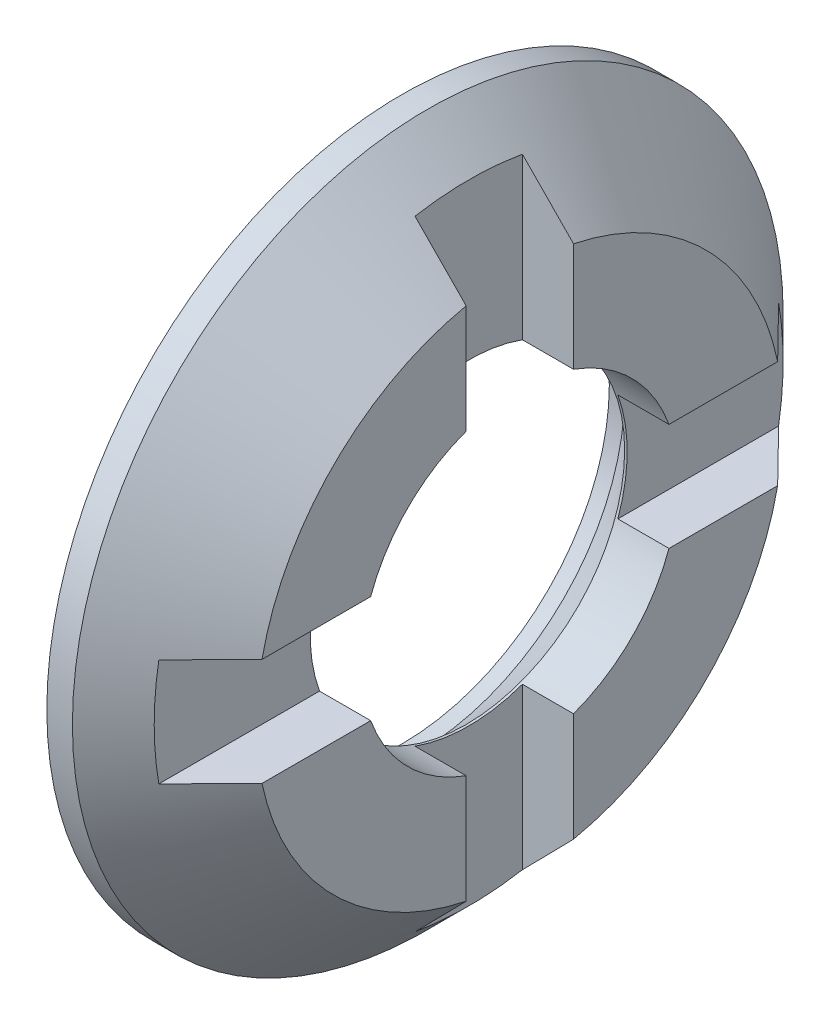
ISO-10303-21;
HEADER;
FILE_DESCRIPTION(('STEP AP214'),'2;1');
FILE_NAME('part.step','',(''),(''),'','','');
FILE_SCHEMA(('AUTOMOTIVE_DESIGN { 1 0 10303 214 1 1 1 1 }'));
ENDSEC;
DATA;
#1=APPLICATION_CONTEXT('core data for automotive mechanical design processes');
#2=APPLICATION_PROTOCOL_DEFINITION('international standard','automotive_design',2000,#1);
#3=PRODUCT_CONTEXT('',#1,'mechanical');
#4=PRODUCT('Part','Part','',(#3));
#5=PRODUCT_RELATED_PRODUCT_CATEGORY('part','',(#4));
#6=PRODUCT_DEFINITION_FORMATION('','',#4);
#7=PRODUCT_DEFINITION_CONTEXT('part definition',#1,'design');
#8=PRODUCT_DEFINITION('design','',#6,#7);
#9=PRODUCT_DEFINITION_SHAPE('','',#8);
#10=(LENGTH_UNIT() NAMED_UNIT(*) SI_UNIT(.MILLI.,.METRE.));
#11=(NAMED_UNIT(*) PLANE_ANGLE_UNIT() SI_UNIT($,.RADIAN.));
#12=(NAMED_UNIT(*) SI_UNIT($,.STERADIAN.) SOLID_ANGLE_UNIT());
#13=UNCERTAINTY_MEASURE_WITH_UNIT(LENGTH_MEASURE(1.E-05),#10,'distance_accuracy_value','');
#14=(GEOMETRIC_REPRESENTATION_CONTEXT(3) GLOBAL_UNCERTAINTY_ASSIGNED_CONTEXT((#13)) GLOBAL_UNIT_ASSIGNED_CONTEXT((#10,
#11,#12)) REPRESENTATION_CONTEXT('',''));
#15=CARTESIAN_POINT('',(0.,0.,0.));
#16=DIRECTION('',(0.,0.,1.));
#17=DIRECTION('',(1.,0.,0.));
#18=AXIS2_PLACEMENT_3D('',#15,#16,#17);
#19=CARTESIAN_POINT('',(-8.43297067855262,15.,-1.05));
#20=DIRECTION('',(0.,0.,-1.));
#21=DIRECTION('',(-1.,0.,0.));
#22=AXIS2_PLACEMENT_3D('',#19,#20,#21);
#23=PLANE('',#22);
#24=CARTESIAN_POINT('',(-8.43297067857819,21.0597029630019,-1.05));
#25=CARTESIAN_POINT('',(-8.2660332643413,20.8903226578739,-1.05));
#26=CARTESIAN_POINT('',(-8.09923122857827,20.7208093520447,-1.05));
#27=CARTESIAN_POINT('',(-7.76589789521229,20.3815167198608,-1.05));
#28=CARTESIAN_POINT('',(-7.59936659763985,20.2117373934761,-1.05));
#29=CARTESIAN_POINT('',(-7.43297067857179,20.0418250663602,-1.05));
#30=B_SPLINE_CURVE_WITH_KNOTS('',3,(#24,#25,#26,#27,#28,#29),.UNSPECIFIED.,.F.,.F.,(4,2,4),(0.,
0.713455758887881,1.4269115982006),.UNSPECIFIED.);
#31=CARTESIAN_POINT('',(-8.43297067858806,21.0597029630119,-1.05));
#32=VERTEX_POINT('',#31);
#33=CARTESIAN_POINT('',(-7.43297067856827,20.0418250663566,-1.05));
#34=VERTEX_POINT('',#33);
#35=EDGE_CURVE('E21',#32,#34,#30,.T.);
#36=ORIENTED_EDGE('',*,*,#35,.F.);
#37=DIRECTION('',(0.,1.,0.));
#38=VECTOR('',#37,1.);
#39=CARTESIAN_POINT('',(-8.43297067855262,15.,-1.05));
#40=LINE('',#39,#38);
#41=CARTESIAN_POINT('',(-8.43297067855262,17.916761903207,-1.05));
#42=VERTEX_POINT('',#41);
#43=EDGE_CURVE('E176',#42,#32,#40,.T.);
#44=ORIENTED_EDGE('',*,*,#43,.F.);
#45=DIRECTION('',(-1.,0.,0.));
#46=VECTOR('',#45,1.);
#47=CARTESIAN_POINT('',(-8.43297067855262,17.916761903207,-1.05));
#48=LINE('',#47,#46);
#49=CARTESIAN_POINT('',(-7.43297067855262,17.916761903207,-1.05));
#50=VERTEX_POINT('',#49);
#51=EDGE_CURVE('E274',#50,#42,#48,.T.);
#52=ORIENTED_EDGE('',*,*,#51,.F.);
#53=DIRECTION('',(0.,1.,0.));
#54=VECTOR('',#53,1.);
#55=CARTESIAN_POINT('',(-7.43297067855262,15.,-1.05));
#56=LINE('',#55,#54);
#57=EDGE_CURVE('E309',#34,#50,#56,.F.);
#58=ORIENTED_EDGE('',*,*,#57,.F.);
#59=EDGE_LOOP('',(#36,#44,#52,#58));
#60=FACE_BOUND('',#59,.T.);
#61=ADVANCED_FACE('F17',(#60),#23,.F.);
#62=CARTESIAN_POINT('',(-8.43297067855262,16.05,0.));
#63=DIRECTION('',(0.,1.,0.));
#64=DIRECTION('',(0.,0.,1.));
#65=AXIS2_PLACEMENT_3D('',#62,#63,#64);
#66=PLANE('',#65);
#67=DIRECTION('',(1.,0.,0.));
#68=VECTOR('',#67,1.);
#69=CARTESIAN_POINT('',(-8.43297067855262,16.05,-2.91676190320704));
#70=LINE('',#69,#68);
#71=CARTESIAN_POINT('',(-8.43297067855262,16.05,-2.91676190320704));
#72=VERTEX_POINT('',#71);
#73=CARTESIAN_POINT('',(-7.43297067855262,16.05,-2.91676190320704));
#74=VERTEX_POINT('',#73);
#75=EDGE_CURVE('E228',#72,#74,#70,.T.);
#76=ORIENTED_EDGE('',*,*,#75,.F.);
#77=DIRECTION('',(0.,0.,-1.));
#78=VECTOR('',#77,1.);
#79=CARTESIAN_POINT('',(-8.43297067855262,16.05,-1.05));
#80=LINE('',#79,#78);
#81=CARTESIAN_POINT('',(-8.43297067858806,16.05,-6.05970296301193));
#82=VERTEX_POINT('',#81);
#83=EDGE_CURVE('E307',#82,#72,#80,.F.);
#84=ORIENTED_EDGE('',*,*,#83,.F.);
#85=CARTESIAN_POINT('',(-7.43297067857179,16.05,-5.04182506636023));
#86=CARTESIAN_POINT('',(-7.59936659763985,16.05,-5.21173739347606));
#87=CARTESIAN_POINT('',(-7.76589789521229,16.05,-5.38151671986083));
#88=CARTESIAN_POINT('',(-8.09923122857828,16.05,-5.72080935204473));
#89=CARTESIAN_POINT('',(-8.26603326434131,16.05,-5.89032265787385));
#90=CARTESIAN_POINT('',(-8.43297067857819,16.05,-6.0597029630019));
#91=B_SPLINE_CURVE_WITH_KNOTS('',3,(#85,#86,#87,#88,#89,#90),.UNSPECIFIED.,.F.,.F.,(4,2,4),(0.,
0.713455839312716,1.4269115982006),.UNSPECIFIED.);
#92=CARTESIAN_POINT('',(-7.43297067856827,16.05,-5.04182506635664));
#93=VERTEX_POINT('',#92);
#94=EDGE_CURVE('E224',#93,#82,#91,.T.);
#95=ORIENTED_EDGE('',*,*,#94,.F.);
#96=DIRECTION('',(0.,0.,-1.));
#97=VECTOR('',#96,1.);
#98=CARTESIAN_POINT('',(-7.43297067855262,16.05,0.));
#99=LINE('',#98,#97);
#100=EDGE_CURVE('E175',#74,#93,#99,.T.);
#101=ORIENTED_EDGE('',*,*,#100,.F.);
#102=EDGE_LOOP('',(#76,#84,#95,#101));
#103=FACE_BOUND('',#102,.T.);
#104=ADVANCED_FACE('F229',(#103),#66,.F.);
#105=CARTESIAN_POINT('',(-8.43297067855262,15.,-1.05));
#106=DIRECTION('',(0.,0.,-1.));
#107=DIRECTION('',(0.,1.,0.));
#108=AXIS2_PLACEMENT_3D('',#105,#106,#107);
#109=PLANE('',#108);
#110=DIRECTION('',(1.,0.,0.));
#111=VECTOR('',#110,1.);
#112=CARTESIAN_POINT('',(-8.43297067855262,12.083238096793,-1.05000000000002));
#113=LINE('',#112,#111);
#114=CARTESIAN_POINT('',(-8.43297067855262,12.083238096793,-1.05000000000003));
#115=VERTEX_POINT('',#114);
#116=CARTESIAN_POINT('',(-7.43297067855262,12.083238096793,-1.05000000000002));
#117=VERTEX_POINT('',#116);
#118=EDGE_CURVE('E269',#115,#117,#113,.T.);
#119=ORIENTED_EDGE('',*,*,#118,.F.);
#120=DIRECTION('',(0.,1.,0.));
#121=VECTOR('',#120,1.);
#122=CARTESIAN_POINT('',(-8.43297067855262,15.,-1.05000000000004));
#123=LINE('',#122,#121);
#124=CARTESIAN_POINT('',(-8.43297067858806,8.94029703698808,-1.05000000000004));
#125=VERTEX_POINT('',#124);
#126=EDGE_CURVE('E117',#125,#115,#123,.T.);
#127=ORIENTED_EDGE('',*,*,#126,.F.);
#128=CARTESIAN_POINT('',(-7.43297067857179,9.95817493363977,-1.05000000000003));
#129=CARTESIAN_POINT('',(-7.59936659763985,9.78826260652394,-1.05000000000003));
#130=CARTESIAN_POINT('',(-7.76589789521229,9.61848328013917,-1.05000000000004));
#131=CARTESIAN_POINT('',(-8.09923122857827,9.27919064795527,-1.05000000000004));
#132=CARTESIAN_POINT('',(-8.2660332643413,9.10967734212615,-1.05000000000004));
#133=CARTESIAN_POINT('',(-8.43297067857818,8.9402970369981,-1.05000000000004));
#134=B_SPLINE_CURVE_WITH_KNOTS('',3,(#128,#129,#130,#131,#132,#133),.UNSPECIFIED.,.F.,.F.,(4,2,
4),(0.,0.713455839312715,1.4269115982006),.UNSPECIFIED.);
#135=CARTESIAN_POINT('',(-7.43297067856827,9.95817493364336,-1.05000000000003));
#136=VERTEX_POINT('',#135);
#137=EDGE_CURVE('E217',#136,#125,#134,.T.);
#138=ORIENTED_EDGE('',*,*,#137,.F.);
#139=DIRECTION('',(0.,1.,0.));
#140=VECTOR('',#139,1.);
#141=CARTESIAN_POINT('',(-7.43297067855262,15.,-1.05000000000002));
#142=LINE('',#141,#140);
#143=EDGE_CURVE('E302',#117,#136,#142,.F.);
#144=ORIENTED_EDGE('',*,*,#143,.F.);
#145=EDGE_LOOP('',(#119,#127,#138,#144));
#146=FACE_BOUND('',#145,.T.);
#147=ADVANCED_FACE('F232',(#146),#109,.F.);
#148=CARTESIAN_POINT('',(-8.43297067855262,13.95,0.));
#149=DIRECTION('',(0.,-1.,0.));
#150=DIRECTION('',(0.,0.,-1.));
#151=AXIS2_PLACEMENT_3D('',#148,#149,#150);
#152=PLANE('',#151);
#153=CARTESIAN_POINT('',(-8.43297067857819,13.9500000000001,-6.05970296300191));
#154=CARTESIAN_POINT('',(-8.26603326434131,13.9500000000001,-5.89032265787387));
#155=CARTESIAN_POINT('',(-8.09923122857827,13.9500000000001,-5.72080935204475));
#156=CARTESIAN_POINT('',(-7.76589789521229,13.9500000000001,-5.38151671986084));
#157=CARTESIAN_POINT('',(-7.59936659763985,13.9500000000001,-5.21173739347608));
#158=CARTESIAN_POINT('',(-7.43297067857179,13.9500000000001,-5.04182506636025));
#159=B_SPLINE_CURVE_WITH_KNOTS('',3,(#153,#154,#155,#156,#157,#158),.UNSPECIFIED.,.F.,.F.,(4,2,
4),(0.,0.713455758887881,1.4269115982006),.UNSPECIFIED.);
#160=CARTESIAN_POINT('',(-8.43297067858806,13.95,-6.05970296301194));
#161=VERTEX_POINT('',#160);
#162=CARTESIAN_POINT('',(-7.43297067856827,13.9500000000001,-5.04182506635665));
#163=VERTEX_POINT('',#162);
#164=EDGE_CURVE('E210',#161,#163,#159,.T.);
#165=ORIENTED_EDGE('',*,*,#164,.F.);
#166=DIRECTION('',(0.,0.,-1.));
#167=VECTOR('',#166,1.);
#168=CARTESIAN_POINT('',(-8.43297067855262,13.95,-1.05));
#169=LINE('',#168,#167);
#170=CARTESIAN_POINT('',(-8.43297067855262,13.95,-2.91676190320706));
#171=VERTEX_POINT('',#170);
#172=EDGE_CURVE('E305',#171,#161,#169,.T.);
#173=ORIENTED_EDGE('',*,*,#172,.F.);
#174=DIRECTION('',(1.,0.,0.));
#175=VECTOR('',#174,1.);
#176=CARTESIAN_POINT('',(-8.43297067855262,13.95,-2.91676190320706));
#177=LINE('',#176,#175);
#178=CARTESIAN_POINT('',(-7.43297067855262,13.95,-2.91676190320706));
#179=VERTEX_POINT('',#178);
#180=EDGE_CURVE('E264',#179,#171,#177,.F.);
#181=ORIENTED_EDGE('',*,*,#180,.F.);
#182=DIRECTION('',(0.,0.,-1.));
#183=VECTOR('',#182,1.);
#184=CARTESIAN_POINT('',(-7.43297067855262,13.9500000000001,0.));
#185=LINE('',#184,#183);
#186=EDGE_CURVE('E299',#163,#179,#185,.F.);
#187=ORIENTED_EDGE('',*,*,#186,.F.);
#188=EDGE_LOOP('',(#165,#173,#181,#187));
#189=FACE_BOUND('',#188,.T.);
#190=ADVANCED_FACE('F236',(#189),#152,.F.);
#191=CARTESIAN_POINT('',(-8.43297067855262,15.,1.05));
#192=DIRECTION('',(0.,0.,1.));
#193=DIRECTION('',(0.,-1.,0.));
#194=AXIS2_PLACEMENT_3D('',#191,#192,#193);
#195=PLANE('',#194);
#196=CARTESIAN_POINT('',(-8.43297067857819,8.94029703699809,1.05));
#197=CARTESIAN_POINT('',(-8.26603326434131,9.10967734212614,1.05));
#198=CARTESIAN_POINT('',(-8.09923122857827,9.27919064795526,1.05));
#199=CARTESIAN_POINT('',(-7.76589789521229,9.61848328013916,1.05));
#200=CARTESIAN_POINT('',(-7.59936659763985,9.78826260652393,1.05));
#201=CARTESIAN_POINT('',(-7.43297067857179,9.95817493363976,1.05));
#202=B_SPLINE_CURVE_WITH_KNOTS('',3,(#196,#197,#198,#199,#200,#201),.UNSPECIFIED.,.F.,.F.,(4,2,
4),(0.,0.713455758887883,1.4269115982006),.UNSPECIFIED.);
#203=CARTESIAN_POINT('',(-8.43297067858806,8.94029703698807,1.04999999999999));
#204=VERTEX_POINT('',#203);
#205=CARTESIAN_POINT('',(-7.43297067856827,9.95817493364335,1.04999999999998));
#206=VERTEX_POINT('',#205);
#207=EDGE_CURVE('E248',#204,#206,#202,.T.);
#208=ORIENTED_EDGE('',*,*,#207,.F.);
#209=DIRECTION('',(0.,1.,0.));
#210=VECTOR('',#209,1.);
#211=CARTESIAN_POINT('',(-8.43297067855261,15.,1.04999999999998));
#212=LINE('',#211,#210);
#213=CARTESIAN_POINT('',(-8.43297067855262,12.0832380967929,1.04999999999999));
#214=VERTEX_POINT('',#213);
#215=EDGE_CURVE('E179',#214,#204,#212,.F.);
#216=ORIENTED_EDGE('',*,*,#215,.F.);
#217=DIRECTION('',(1.,0.,0.));
#218=VECTOR('',#217,1.);
#219=CARTESIAN_POINT('',(-8.43297067855262,12.0832380967929,1.05));
#220=LINE('',#219,#218);
#221=CARTESIAN_POINT('',(-7.43297067855262,12.0832380967929,1.04999999999998));
#222=VERTEX_POINT('',#221);
#223=EDGE_CURVE('E252',#222,#214,#220,.F.);
#224=ORIENTED_EDGE('',*,*,#223,.F.);
#225=DIRECTION('',(0.,1.,0.));
#226=VECTOR('',#225,1.);
#227=CARTESIAN_POINT('',(-7.43297067855262,15.,1.04999999999997));
#228=LINE('',#227,#226);
#229=EDGE_CURVE('E293',#206,#222,#228,.T.);
#230=ORIENTED_EDGE('',*,*,#229,.F.);
#231=EDGE_LOOP('',(#208,#216,#224,#230));
#232=FACE_BOUND('',#231,.T.);
#233=ADVANCED_FACE('F241',(#232),#195,.F.);
#234=CARTESIAN_POINT('',(-8.43297067855262,13.95,0.));
#235=DIRECTION('',(0.,-1.,0.));
#236=DIRECTION('',(0.,0.,-1.));
#237=AXIS2_PLACEMENT_3D('',#234,#235,#236);
#238=PLANE('',#237);
#239=DIRECTION('',(1.,0.,0.));
#240=VECTOR('',#239,1.);
#241=CARTESIAN_POINT('',(-8.43297067855262,13.95,2.91676190320705));
#242=LINE('',#241,#240);
#243=CARTESIAN_POINT('',(-8.43297067855261,13.95,2.91676190320705));
#244=VERTEX_POINT('',#243);
#245=CARTESIAN_POINT('',(-7.43297067855262,13.95,2.91676190320705));
#246=VERTEX_POINT('',#245);
#247=EDGE_CURVE('E255',#244,#246,#242,.T.);
#248=ORIENTED_EDGE('',*,*,#247,.F.);
#249=DIRECTION('',(0.,0.,-1.));
#250=VECTOR('',#249,1.);
#251=CARTESIAN_POINT('',(-8.43297067855262,13.95,-1.05));
#252=LINE('',#251,#250);
#253=CARTESIAN_POINT('',(-8.43297067858806,13.95,6.05970296301193));
#254=VERTEX_POINT('',#253);
#255=EDGE_CURVE('E128',#254,#244,#252,.T.);
#256=ORIENTED_EDGE('',*,*,#255,.F.);
#257=CARTESIAN_POINT('',(-7.43297067857179,13.95,5.04182506636024));
#258=CARTESIAN_POINT('',(-7.59936659763985,13.95,5.21173739347607));
#259=CARTESIAN_POINT('',(-7.76589789521228,13.95,5.38151671986083));
#260=CARTESIAN_POINT('',(-8.09923122857827,13.95,5.72080935204474));
#261=CARTESIAN_POINT('',(-8.2660332643413,13.95,5.89032265787386));
#262=CARTESIAN_POINT('',(-8.43297067857818,13.95,6.0597029630019));
#263=B_SPLINE_CURVE_WITH_KNOTS('',3,(#257,#258,#259,#260,#261,#262),.UNSPECIFIED.,.F.,.F.,(4,2,
4),(0.,0.713455839312714,1.42691159820059),.UNSPECIFIED.);
#264=CARTESIAN_POINT('',(-7.43297067856826,13.95,5.04182506635664));
#265=VERTEX_POINT('',#264);
#266=EDGE_CURVE('E134',#265,#254,#263,.T.);
#267=ORIENTED_EDGE('',*,*,#266,.F.);
#268=DIRECTION('',(0.,0.,-1.));
#269=VECTOR('',#268,1.);
#270=CARTESIAN_POINT('',(-7.43297067855262,13.95,0.));
#271=LINE('',#270,#269);
#272=EDGE_CURVE('E296',#246,#265,#271,.F.);
#273=ORIENTED_EDGE('',*,*,#272,.F.);
#274=EDGE_LOOP('',(#248,#256,#267,#273));
#275=FACE_BOUND('',#274,.T.);
#276=ADVANCED_FACE('F245',(#275),#238,.F.);
#277=CARTESIAN_POINT('',(-8.43297067855262,15.,1.05));
#278=DIRECTION('',(0.,0.,1.));
#279=DIRECTION('',(0.,-1.,0.));
#280=AXIS2_PLACEMENT_3D('',#277,#278,#279);
#281=PLANE('',#280);
#282=DIRECTION('',(1.,0.,0.));
#283=VECTOR('',#282,1.);
#284=CARTESIAN_POINT('',(-8.43297067855262,17.916761903207,1.05));
#285=LINE('',#284,#283);
#286=CARTESIAN_POINT('',(-8.43297067855261,17.916761903207,1.05));
#287=VERTEX_POINT('',#286);
#288=CARTESIAN_POINT('',(-7.43297067855262,17.916761903207,1.05));
#289=VERTEX_POINT('',#288);
#290=EDGE_CURVE('E323',#287,#289,#285,.T.);
#291=ORIENTED_EDGE('',*,*,#290,.F.);
#292=DIRECTION('',(0.,1.,0.));
#293=VECTOR('',#292,1.);
#294=CARTESIAN_POINT('',(-8.43297067855261,15.,1.05));
#295=LINE('',#294,#293);
#296=CARTESIAN_POINT('',(-8.43297067858806,21.0597029630119,1.05));
#297=VERTEX_POINT('',#296);
#298=EDGE_CURVE('E178',#297,#287,#295,.F.);
#299=ORIENTED_EDGE('',*,*,#298,.F.);
#300=CARTESIAN_POINT('',(-7.43297067857179,20.0418250663602,1.05));
#301=CARTESIAN_POINT('',(-7.59936659763985,20.2117373934761,1.05));
#302=CARTESIAN_POINT('',(-7.76589789521229,20.3815167198608,1.05));
#303=CARTESIAN_POINT('',(-8.09923122857827,20.7208093520447,1.05));
#304=CARTESIAN_POINT('',(-8.2660332643413,20.8903226578739,1.05));
#305=CARTESIAN_POINT('',(-8.43297067857818,21.0597029630019,1.05));
#306=B_SPLINE_CURVE_WITH_KNOTS('',3,(#300,#301,#302,#303,#304,#305),.UNSPECIFIED.,.F.,.F.,(4,2,
4),(0.,0.713455839312717,1.4269115982006),.UNSPECIFIED.);
#307=CARTESIAN_POINT('',(-7.43297067856827,20.0418250663566,1.05));
#308=VERTEX_POINT('',#307);
#309=EDGE_CURVE('E40',#308,#297,#306,.T.);
#310=ORIENTED_EDGE('',*,*,#309,.F.);
#311=DIRECTION('',(0.,1.,0.));
#312=VECTOR('',#311,1.);
#313=CARTESIAN_POINT('',(-7.43297067855262,15.,1.05));
#314=LINE('',#313,#312);
#315=EDGE_CURVE('E127',#289,#308,#314,.T.);
#316=ORIENTED_EDGE('',*,*,#315,.F.);
#317=EDGE_LOOP('',(#291,#299,#310,#316));
#318=FACE_BOUND('',#317,.T.);
#319=ADVANCED_FACE('F382',(#318),#281,.F.);
#320=CARTESIAN_POINT('',(-8.43297067855262,16.05,0.));
#321=DIRECTION('',(0.,1.,0.));
#322=DIRECTION('',(0.,0.,1.));
#323=AXIS2_PLACEMENT_3D('',#320,#321,#322);
#324=PLANE('',#323);
#325=CARTESIAN_POINT('',(-8.43297067857818,16.05,6.05970296300191));
#326=CARTESIAN_POINT('',(-8.2660332643413,16.05,5.89032265787387));
#327=CARTESIAN_POINT('',(-8.09923122857827,16.05,5.72080935204474));
#328=CARTESIAN_POINT('',(-7.76589789521228,16.05,5.38151671986084));
#329=CARTESIAN_POINT('',(-7.59936659763985,16.05,5.21173739347607));
#330=CARTESIAN_POINT('',(-7.43297067857179,16.05,5.04182506636025));
#331=B_SPLINE_CURVE_WITH_KNOTS('',3,(#325,#326,#327,#328,#329,#330),.UNSPECIFIED.,.F.,.F.,(4,2,
4),(0.,0.713455758887883,1.4269115982006),.UNSPECIFIED.);
#332=CARTESIAN_POINT('',(-8.43297067858806,16.05,6.05970296301193));
#333=VERTEX_POINT('',#332);
#334=CARTESIAN_POINT('',(-7.43297067856826,16.05,5.04182506635665));
#335=VERTEX_POINT('',#334);
#336=EDGE_CURVE('E104',#333,#335,#331,.T.);
#337=ORIENTED_EDGE('',*,*,#336,.F.);
#338=DIRECTION('',(0.,0.,-1.));
#339=VECTOR('',#338,1.);
#340=CARTESIAN_POINT('',(-8.43297067855262,16.05,-1.05));
#341=LINE('',#340,#339);
#342=CARTESIAN_POINT('',(-8.43297067855261,16.05,2.91676190320705));
#343=VERTEX_POINT('',#342);
#344=EDGE_CURVE('E109',#343,#333,#341,.F.);
#345=ORIENTED_EDGE('',*,*,#344,.F.);
#346=DIRECTION('',(1.,0.,0.));
#347=VECTOR('',#346,1.);
#348=CARTESIAN_POINT('',(-8.43297067855262,16.05,2.91676190320705));
#349=LINE('',#348,#347);
#350=CARTESIAN_POINT('',(-7.43297067855261,16.05,2.91676190320705));
#351=VERTEX_POINT('',#350);
#352=EDGE_CURVE('E118',#351,#343,#349,.F.);
#353=ORIENTED_EDGE('',*,*,#352,.F.);
#354=DIRECTION('',(0.,0.,-1.));
#355=VECTOR('',#354,1.);
#356=CARTESIAN_POINT('',(-7.43297067855262,16.05,0.));
#357=LINE('',#356,#355);
#358=EDGE_CURVE('E112',#335,#351,#357,.T.);
#359=ORIENTED_EDGE('',*,*,#358,.F.);
#360=EDGE_LOOP('',(#337,#345,#353,#359));
#361=FACE_BOUND('',#360,.T.);
#362=ADVANCED_FACE('F106',(#361),#324,.F.);
#363=CARTESIAN_POINT('',(-8.43297067855262,15.,-1.05));
#364=DIRECTION('',(1.,0.,0.));
#365=DIRECTION('',(0.,0.,-1.));
#366=AXIS2_PLACEMENT_3D('',#363,#364,#365);
#367=PLANE('',#366);
#368=ORIENTED_EDGE('',*,*,#215,.T.);
#369=CARTESIAN_POINT('',(-8.43297067859794,15.,0.));
#370=DIRECTION('',(-1.,0.,0.));
#371=DIRECTION('',(0.,0.,1.));
#372=AXIS2_PLACEMENT_3D('',#369,#370,#371);
#373=CIRCLE('',#372,6.15000000000464);
#374=EDGE_CURVE('E177',#204,#125,#373,.F.);
#375=ORIENTED_EDGE('',*,*,#374,.T.);
#376=ORIENTED_EDGE('',*,*,#126,.T.);
#377=CARTESIAN_POINT('',(-8.43297067855262,15.,0.));
#378=DIRECTION('',(-1.,0.,0.));
#379=DIRECTION('',(0.,0.,1.));
#380=AXIS2_PLACEMENT_3D('',#377,#378,#379);
#381=CIRCLE('',#380,3.1);
#382=EDGE_CURVE('E167',#115,#214,#381,.T.);
#383=ORIENTED_EDGE('',*,*,#382,.T.);
#384=EDGE_LOOP('',(#368,#375,#376,#383));
#385=FACE_BOUND('',#384,.T.);
#386=ADVANCED_FACE('F344',(#385),#367,.T.);
#387=CARTESIAN_POINT('',(-8.43297067855262,15.,-1.05));
#388=DIRECTION('',(1.,0.,0.));
#389=DIRECTION('',(0.,0.,-1.));
#390=AXIS2_PLACEMENT_3D('',#387,#388,#389);
#391=PLANE('',#390);
#392=ORIENTED_EDGE('',*,*,#43,.T.);
#393=CARTESIAN_POINT('',(-8.43297067859794,15.,0.));
#394=DIRECTION('',(-1.,0.,0.));
#395=DIRECTION('',(0.,0.,1.));
#396=AXIS2_PLACEMENT_3D('',#393,#394,#395);
#397=CIRCLE('',#396,6.15000000000464);
#398=EDGE_CURVE('E173',#32,#297,#397,.F.);
#399=ORIENTED_EDGE('',*,*,#398,.T.);
#400=ORIENTED_EDGE('',*,*,#298,.T.);
#401=CARTESIAN_POINT('',(-8.43297067855262,15.,0.));
#402=DIRECTION('',(-1.,0.,0.));
#403=DIRECTION('',(0.,0.,1.));
#404=AXIS2_PLACEMENT_3D('',#401,#402,#403);
#405=CIRCLE('',#404,3.1);
#406=EDGE_CURVE('E157',#287,#42,#405,.T.);
#407=ORIENTED_EDGE('',*,*,#406,.T.);
#408=EDGE_LOOP('',(#392,#399,#400,#407));
#409=FACE_BOUND('',#408,.T.);
#410=ADVANCED_FACE('F381',(#409),#391,.T.);
#411=CARTESIAN_POINT('',(-7.43297067855262,15.,0.));
#412=DIRECTION('',(1.,0.,0.));
#413=DIRECTION('',(0.,0.,-1.));
#414=AXIS2_PLACEMENT_3D('',#411,#412,#413);
#415=PLANE('',#414);
#416=CARTESIAN_POINT('',(-7.43297067856474,15.,0.));
#417=DIRECTION('',(-1.,0.,0.));
#418=DIRECTION('',(0.,0.,1.));
#419=AXIS2_PLACEMENT_3D('',#416,#417,#418);
#420=CIRCLE('',#419,5.14999999997144);
#421=EDGE_CURVE('E150',#34,#93,#420,.T.);
#422=ORIENTED_EDGE('',*,*,#421,.F.);
#423=ORIENTED_EDGE('',*,*,#57,.T.);
#424=CARTESIAN_POINT('',(-7.43297067855262,15.,0.));
#425=DIRECTION('',(-1.,0.,0.));
#426=DIRECTION('',(0.,0.,1.));
#427=AXIS2_PLACEMENT_3D('',#424,#425,#426);
#428=CIRCLE('',#427,3.1);
#429=EDGE_CURVE('E154',#50,#74,#428,.T.);
#430=ORIENTED_EDGE('',*,*,#429,.T.);
#431=ORIENTED_EDGE('',*,*,#100,.T.);
#432=EDGE_LOOP('',(#422,#423,#430,#431));
#433=FACE_BOUND('',#432,.T.);
#434=ADVANCED_FACE('F372',(#433),#415,.T.);
#435=CARTESIAN_POINT('',(-8.43297067855262,15.,-1.05));
#436=DIRECTION('',(1.,0.,0.));
#437=DIRECTION('',(0.,0.,-1.));
#438=AXIS2_PLACEMENT_3D('',#435,#436,#437);
#439=PLANE('',#438);
#440=CARTESIAN_POINT('',(-8.43297067855262,15.,0.));
#441=DIRECTION('',(-1.,0.,0.));
#442=DIRECTION('',(0.,0.,1.));
#443=AXIS2_PLACEMENT_3D('',#440,#441,#442);
#444=CIRCLE('',#443,3.1);
#445=EDGE_CURVE('E94',#72,#171,#444,.T.);
#446=ORIENTED_EDGE('',*,*,#445,.T.);
#447=ORIENTED_EDGE('',*,*,#172,.T.);
#448=CARTESIAN_POINT('',(-8.43297067859794,15.,0.));
#449=DIRECTION('',(-1.,0.,0.));
#450=DIRECTION('',(0.,0.,1.));
#451=AXIS2_PLACEMENT_3D('',#448,#449,#450);
#452=CIRCLE('',#451,6.15000000000464);
#453=EDGE_CURVE('E147',#82,#161,#452,.T.);
#454=ORIENTED_EDGE('',*,*,#453,.F.);
#455=ORIENTED_EDGE('',*,*,#83,.T.);
#456=EDGE_LOOP('',(#446,#447,#454,#455));
#457=FACE_BOUND('',#456,.T.);
#458=ADVANCED_FACE('F375',(#457),#439,.T.);
#459=CARTESIAN_POINT('',(-7.43297067855262,15.,0.));
#460=DIRECTION('',(1.,0.,0.));
#461=DIRECTION('',(0.,0.,-1.));
#462=AXIS2_PLACEMENT_3D('',#459,#460,#461);
#463=PLANE('',#462);
#464=CARTESIAN_POINT('',(-7.43297067856474,15.,0.));
#465=DIRECTION('',(-1.,0.,0.));
#466=DIRECTION('',(0.,0.,1.));
#467=AXIS2_PLACEMENT_3D('',#464,#465,#466);
#468=CIRCLE('',#467,5.14999999997144);
#469=EDGE_CURVE('E141',#163,#136,#468,.T.);
#470=ORIENTED_EDGE('',*,*,#469,.F.);
#471=ORIENTED_EDGE('',*,*,#186,.T.);
#472=CARTESIAN_POINT('',(-7.43297067855262,15.,0.));
#473=DIRECTION('',(-1.,0.,0.));
#474=DIRECTION('',(0.,0.,1.));
#475=AXIS2_PLACEMENT_3D('',#472,#473,#474);
#476=CIRCLE('',#475,3.1);
#477=EDGE_CURVE('E170',#179,#117,#476,.T.);
#478=ORIENTED_EDGE('',*,*,#477,.T.);
#479=ORIENTED_EDGE('',*,*,#143,.T.);
#480=EDGE_LOOP('',(#470,#471,#478,#479));
#481=FACE_BOUND('',#480,.T.);
#482=ADVANCED_FACE('F379',(#481),#463,.T.);
#483=CARTESIAN_POINT('',(-7.43297067855262,15.,0.));
#484=DIRECTION('',(1.,0.,0.));
#485=DIRECTION('',(0.,0.,-1.));
#486=AXIS2_PLACEMENT_3D('',#483,#484,#485);
#487=PLANE('',#486);
#488=CARTESIAN_POINT('',(-7.43297067856474,15.,0.));
#489=DIRECTION('',(-1.,0.,0.));
#490=DIRECTION('',(0.,0.,1.));
#491=AXIS2_PLACEMENT_3D('',#488,#489,#490);
#492=CIRCLE('',#491,5.14999999997144);
#493=EDGE_CURVE('E137',#206,#265,#492,.T.);
#494=ORIENTED_EDGE('',*,*,#493,.F.);
#495=ORIENTED_EDGE('',*,*,#229,.T.);
#496=CARTESIAN_POINT('',(-7.43297067855262,15.,0.));
#497=DIRECTION('',(-1.,0.,0.));
#498=DIRECTION('',(0.,0.,1.));
#499=AXIS2_PLACEMENT_3D('',#496,#497,#498);
#500=CIRCLE('',#499,3.1);
#501=EDGE_CURVE('E164',#222,#246,#500,.T.);
#502=ORIENTED_EDGE('',*,*,#501,.T.);
#503=ORIENTED_EDGE('',*,*,#272,.T.);
#504=EDGE_LOOP('',(#494,#495,#502,#503));
#505=FACE_BOUND('',#504,.T.);
#506=ADVANCED_FACE('F339',(#505),#487,.T.);
#507=CARTESIAN_POINT('',(-8.43297067855262,15.,-1.05));
#508=DIRECTION('',(1.,0.,0.));
#509=DIRECTION('',(0.,0.,-1.));
#510=AXIS2_PLACEMENT_3D('',#507,#508,#509);
#511=PLANE('',#510);
#512=CARTESIAN_POINT('',(-8.43297067855262,15.,0.));
#513=DIRECTION('',(-1.,0.,0.));
#514=DIRECTION('',(0.,0.,1.));
#515=AXIS2_PLACEMENT_3D('',#512,#513,#514);
#516=CIRCLE('',#515,3.1);
#517=EDGE_CURVE('E126',#244,#343,#516,.T.);
#518=ORIENTED_EDGE('',*,*,#517,.T.);
#519=ORIENTED_EDGE('',*,*,#344,.T.);
#520=CARTESIAN_POINT('',(-8.43297067859794,15.,0.));
#521=DIRECTION('',(-1.,0.,0.));
#522=DIRECTION('',(0.,0.,1.));
#523=AXIS2_PLACEMENT_3D('',#520,#521,#522);
#524=CIRCLE('',#523,6.15000000000464);
#525=EDGE_CURVE('E124',#254,#333,#524,.T.);
#526=ORIENTED_EDGE('',*,*,#525,.F.);
#527=ORIENTED_EDGE('',*,*,#255,.T.);
#528=EDGE_LOOP('',(#518,#519,#526,#527));
#529=FACE_BOUND('',#528,.T.);
#530=ADVANCED_FACE('F122',(#529),#511,.T.);
#531=CARTESIAN_POINT('',(-7.43297067855262,15.,0.));
#532=DIRECTION('',(1.,0.,0.));
#533=DIRECTION('',(0.,0.,-1.));
#534=AXIS2_PLACEMENT_3D('',#531,#532,#533);
#535=PLANE('',#534);
#536=CARTESIAN_POINT('',(-7.43297067856474,15.,0.));
#537=DIRECTION('',(-1.,0.,0.));
#538=DIRECTION('',(0.,0.,1.));
#539=AXIS2_PLACEMENT_3D('',#536,#537,#538);
#540=CIRCLE('',#539,5.14999999997144);
#541=EDGE_CURVE('E136',#335,#308,#540,.T.);
#542=ORIENTED_EDGE('',*,*,#541,.F.);
#543=ORIENTED_EDGE('',*,*,#358,.T.);
#544=CARTESIAN_POINT('',(-7.43297067855262,15.,0.));
#545=DIRECTION('',(-1.,0.,0.));
#546=DIRECTION('',(0.,0.,1.));
#547=AXIS2_PLACEMENT_3D('',#544,#545,#546);
#548=CIRCLE('',#547,3.1);
#549=EDGE_CURVE('E160',#351,#289,#548,.T.);
#550=ORIENTED_EDGE('',*,*,#549,.T.);
#551=ORIENTED_EDGE('',*,*,#315,.T.);
#552=EDGE_LOOP('',(#542,#543,#550,#551));
#553=FACE_BOUND('',#552,.T.);
#554=ADVANCED_FACE('F384',(#553),#535,.T.);
#555=CARTESIAN_POINT('',(-1.73297067855261,15.,0.));
#556=DIRECTION('',(-1.,0.,0.));
#557=DIRECTION('',(0.,0.,1.));
#558=AXIS2_PLACEMENT_3D('',#555,#556,#557);
#559=CYLINDRICAL_SURFACE('',#558,3.1);
#560=CARTESIAN_POINT('',(-8.48297067852854,15.,0.));
#561=DIRECTION('',(-1.,0.,0.));
#562=DIRECTION('',(0.,0.,-1.));
#563=AXIS2_PLACEMENT_3D('',#560,#561,#562);
#564=CIRCLE('',#563,3.10000000001765);
#565=CARTESIAN_POINT('',(-8.48297067852855,15.,-3.10000000001764));
#566=VERTEX_POINT('',#565);
#567=EDGE_CURVE('E139',#566,#566,#564,.T.);
#568=ORIENTED_EDGE('',*,*,#567,.T.);
#569=EDGE_LOOP('',(#568));
#570=FACE_BOUND('',#569,.T.);
#571=ORIENTED_EDGE('',*,*,#180,.T.);
#572=ORIENTED_EDGE('',*,*,#445,.F.);
#573=ORIENTED_EDGE('',*,*,#75,.T.);
#574=ORIENTED_EDGE('',*,*,#429,.F.);
#575=ORIENTED_EDGE('',*,*,#51,.T.);
#576=ORIENTED_EDGE('',*,*,#406,.F.);
#577=ORIENTED_EDGE('',*,*,#290,.T.);
#578=ORIENTED_EDGE('',*,*,#549,.F.);
#579=ORIENTED_EDGE('',*,*,#352,.T.);
#580=ORIENTED_EDGE('',*,*,#517,.F.);
#581=ORIENTED_EDGE('',*,*,#247,.T.);
#582=ORIENTED_EDGE('',*,*,#501,.F.);
#583=ORIENTED_EDGE('',*,*,#223,.T.);
#584=ORIENTED_EDGE('',*,*,#382,.F.);
#585=ORIENTED_EDGE('',*,*,#118,.T.);
#586=ORIENTED_EDGE('',*,*,#477,.F.);
#587=EDGE_LOOP('',(#571,#572,#573,#574,#575,#576,#577,#578,#579,#580,#581,#582,#583,#584,#585,#586));
#588=FACE_BOUND('',#587,.T.);
#589=ADVANCED_FACE('F197',(#570,#588),#559,.F.);
#590=CARTESIAN_POINT('',(-9.2329706786245,15.,0.));
#591=DIRECTION('',(-1.,0.,0.));
#592=DIRECTION('',(0.,0.,1.));
#593=AXIS2_PLACEMENT_3D('',#590,#591,#592);
#594=CONICAL_SURFACE('',#593,6.95000000003119,0.785398163397449);
#595=ORIENTED_EDGE('',*,*,#137,.T.);
#596=ORIENTED_EDGE('',*,*,#374,.F.);
#597=ORIENTED_EDGE('',*,*,#207,.T.);
#598=ORIENTED_EDGE('',*,*,#493,.T.);
#599=ORIENTED_EDGE('',*,*,#266,.T.);
#600=ORIENTED_EDGE('',*,*,#525,.T.);
#601=ORIENTED_EDGE('',*,*,#336,.T.);
#602=ORIENTED_EDGE('',*,*,#541,.T.);
#603=ORIENTED_EDGE('',*,*,#309,.T.);
#604=ORIENTED_EDGE('',*,*,#398,.F.);
#605=ORIENTED_EDGE('',*,*,#35,.T.);
#606=ORIENTED_EDGE('',*,*,#421,.T.);
#607=ORIENTED_EDGE('',*,*,#94,.T.);
#608=ORIENTED_EDGE('',*,*,#453,.T.);
#609=ORIENTED_EDGE('',*,*,#164,.T.);
#610=ORIENTED_EDGE('',*,*,#469,.T.);
#611=EDGE_LOOP('',(#595,#596,#597,#598,#599,#600,#601,#602,#603,#604,#605,#606,#607,#608,#609,#610));
#612=FACE_BOUND('',#611,.T.);
#613=CARTESIAN_POINT('',(-9.23297067855261,15.,0.));
#614=DIRECTION('',(-1.,0.,0.));
#615=DIRECTION('',(0.,0.,1.));
#616=AXIS2_PLACEMENT_3D('',#613,#614,#615);
#617=CIRCLE('',#616,6.95);
#618=CARTESIAN_POINT('',(-9.23297067855261,15.,6.95));
#619=VERTEX_POINT('',#618);
#620=EDGE_CURVE('E281',#619,#619,#617,.T.);
#621=ORIENTED_EDGE('',*,*,#620,.F.);
#622=EDGE_LOOP('',(#621));
#623=FACE_BOUND('',#622,.T.);
#624=ADVANCED_FACE('F131',(#612,#623),#594,.T.);
#625=CARTESIAN_POINT('',(-9.43297067851745,15.,0.));
#626=DIRECTION('',(-1.,0.,0.));
#627=DIRECTION('',(0.,0.,1.));
#628=AXIS2_PLACEMENT_3D('',#625,#626,#627);
#629=CONICAL_SURFACE('',#628,4.04999999994971,0.785398163397448);
#630=ORIENTED_EDGE('',*,*,#567,.F.);
#631=EDGE_LOOP('',(#630));
#632=FACE_BOUND('',#631,.T.);
#633=CARTESIAN_POINT('',(-9.43297067855262,15.,0.));
#634=DIRECTION('',(-1.,0.,0.));
#635=DIRECTION('',(0.,0.,1.));
#636=AXIS2_PLACEMENT_3D('',#633,#634,#635);
#637=CIRCLE('',#636,4.05);
#638=CARTESIAN_POINT('',(-9.43297067855261,15.,4.05));
#639=VERTEX_POINT('',#638);
#640=EDGE_CURVE('E277',#639,#639,#637,.T.);
#641=ORIENTED_EDGE('',*,*,#640,.T.);
#642=EDGE_LOOP('',(#641));
#643=FACE_BOUND('',#642,.T.);
#644=ADVANCED_FACE('F196',(#632,#643),#629,.F.);
#645=CARTESIAN_POINT('',(-9.73297067855261,15.,0.));
#646=DIRECTION('',(-1.,0.,0.));
#647=DIRECTION('',(0.,0.,1.));
#648=AXIS2_PLACEMENT_3D('',#645,#646,#647);
#649=CYLINDRICAL_SURFACE('',#648,6.95);
#650=CARTESIAN_POINT('',(-9.73297067855261,15.,0.));
#651=DIRECTION('',(-1.,0.,0.));
#652=DIRECTION('',(0.,0.,1.));
#653=AXIS2_PLACEMENT_3D('',#650,#651,#652);
#654=CIRCLE('',#653,6.95);
#655=CARTESIAN_POINT('',(-9.73297067855261,15.,6.95));
#656=VERTEX_POINT('',#655);
#657=EDGE_CURVE('E31',#656,#656,#654,.T.);
#658=ORIENTED_EDGE('',*,*,#657,.F.);
#659=EDGE_LOOP('',(#658));
#660=FACE_BOUND('',#659,.T.);
#661=ORIENTED_EDGE('',*,*,#620,.T.);
#662=EDGE_LOOP('',(#661));
#663=FACE_BOUND('',#662,.T.);
#664=ADVANCED_FACE('F401',(#660,#663),#649,.T.);
#665=CARTESIAN_POINT('',(-1.73297067855261,15.,0.));
#666=DIRECTION('',(-1.,0.,0.));
#667=DIRECTION('',(0.,0.,1.));
#668=AXIS2_PLACEMENT_3D('',#665,#666,#667);
#669=CYLINDRICAL_SURFACE('',#668,4.05);
#670=CARTESIAN_POINT('',(-9.73297067855261,15.,0.));
#671=DIRECTION('',(-1.,0.,0.));
#672=DIRECTION('',(0.,0.,1.));
#673=AXIS2_PLACEMENT_3D('',#670,#671,#672);
#674=CIRCLE('',#673,4.05);
#675=CARTESIAN_POINT('',(-9.73297067855261,15.,4.05));
#676=VERTEX_POINT('',#675);
#677=EDGE_CURVE('E11',#676,#676,#674,.F.);
#678=ORIENTED_EDGE('',*,*,#677,.F.);
#679=EDGE_LOOP('',(#678));
#680=FACE_BOUND('',#679,.T.);
#681=ORIENTED_EDGE('',*,*,#640,.F.);
#682=EDGE_LOOP('',(#681));
#683=FACE_BOUND('',#682,.T.);
#684=ADVANCED_FACE('F395',(#680,#683),#669,.F.);
#685=CARTESIAN_POINT('',(-9.73297067855261,15.,0.));
#686=DIRECTION('',(-1.,0.,0.));
#687=DIRECTION('',(0.,0.,1.));
#688=AXIS2_PLACEMENT_3D('',#685,#686,#687);
#689=PLANE('',#688);
#690=ORIENTED_EDGE('',*,*,#677,.T.);
#691=EDGE_LOOP('',(#690));
#692=FACE_BOUND('',#691,.T.);
#693=ORIENTED_EDGE('',*,*,#657,.T.);
#694=EDGE_LOOP('',(#693));
#695=FACE_BOUND('',#694,.T.);
#696=ADVANCED_FACE('F393',(#692,#695),#689,.T.);
#697=CLOSED_SHELL('',(#61,#104,#147,#190,#233,#276,#319,#362,#386,#410,#434,#458,#482,#506,#530,
#554,#589,#624,#644,#664,#684,#696));
#698=MANIFOLD_SOLID_BREP('B1',#697);
#699=ADVANCED_BREP_SHAPE_REPRESENTATION('',(#18,#698),#14);
#700=SHAPE_DEFINITION_REPRESENTATION(#9,#699);
ENDSEC;
END-ISO-10303-21;
